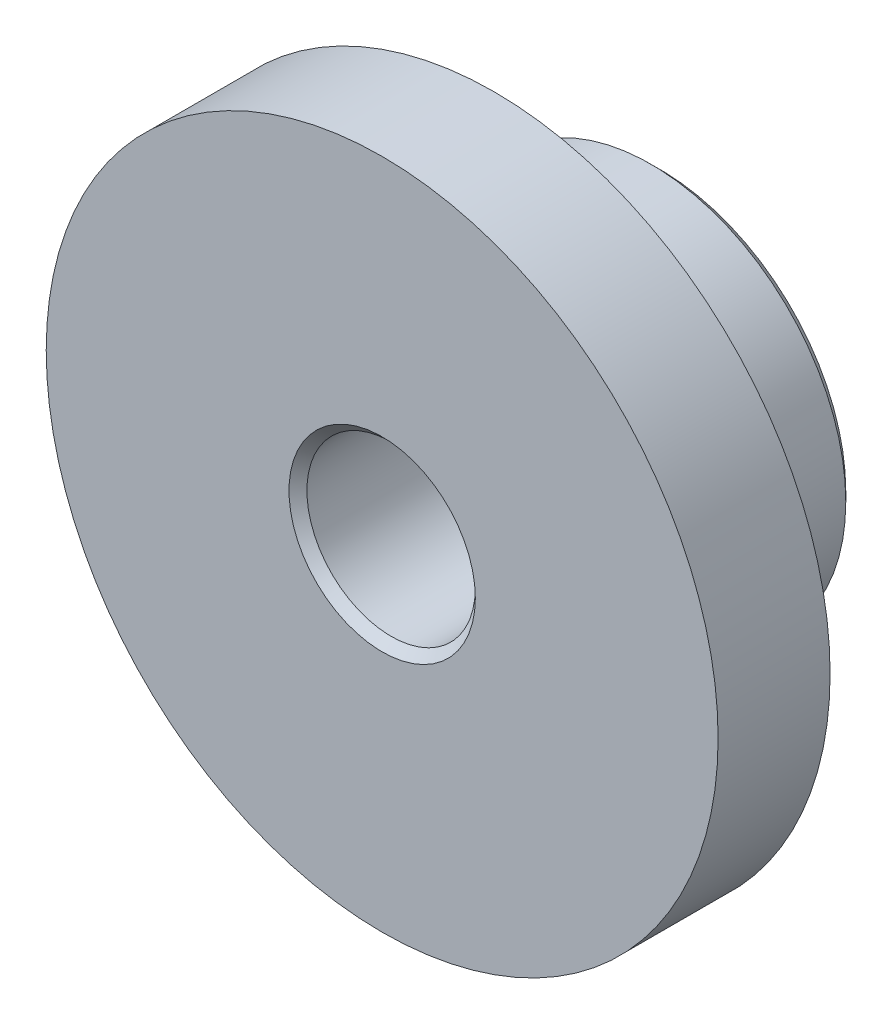
ISO-10303-21;
HEADER;
FILE_DESCRIPTION(('STEP AP214'),'2;1');
FILE_NAME('part.step','',(''),(''),'','','');
FILE_SCHEMA(('AUTOMOTIVE_DESIGN { 1 0 10303 214 1 1 1 1 }'));
ENDSEC;
DATA;
#1=APPLICATION_CONTEXT('core data for automotive mechanical design processes');
#2=APPLICATION_PROTOCOL_DEFINITION('international standard','automotive_design',2000,#1);
#3=PRODUCT_CONTEXT('',#1,'mechanical');
#4=PRODUCT('Part','Part','',(#3));
#5=PRODUCT_RELATED_PRODUCT_CATEGORY('part','',(#4));
#6=PRODUCT_DEFINITION_FORMATION('','',#4);
#7=PRODUCT_DEFINITION_CONTEXT('part definition',#1,'design');
#8=PRODUCT_DEFINITION('design','',#6,#7);
#9=PRODUCT_DEFINITION_SHAPE('','',#8);
#10=(LENGTH_UNIT() NAMED_UNIT(*) SI_UNIT(.MILLI.,.METRE.));
#11=(NAMED_UNIT(*) PLANE_ANGLE_UNIT() SI_UNIT($,.RADIAN.));
#12=(NAMED_UNIT(*) SI_UNIT($,.STERADIAN.) SOLID_ANGLE_UNIT());
#13=UNCERTAINTY_MEASURE_WITH_UNIT(LENGTH_MEASURE(1.E-05),#10,'distance_accuracy_value','');
#14=(GEOMETRIC_REPRESENTATION_CONTEXT(3) GLOBAL_UNCERTAINTY_ASSIGNED_CONTEXT((#13)) GLOBAL_UNIT_ASSIGNED_CONTEXT((#10,
#11,#12)) REPRESENTATION_CONTEXT('',''));
#15=CARTESIAN_POINT('',(0.,0.,0.));
#16=DIRECTION('',(0.,0.,1.));
#17=DIRECTION('',(1.,0.,0.));
#18=AXIS2_PLACEMENT_3D('',#15,#16,#17);
#19=CARTESIAN_POINT('',(0.,0.,15.748));
#20=DIRECTION('',(0.,0.,-1.));
#21=DIRECTION('',(-1.,0.,0.));
#22=AXIS2_PLACEMENT_3D('',#19,#20,#21);
#23=CYLINDRICAL_SURFACE('',#22,19.05);
#24=CARTESIAN_POINT('',(0.,0.,15.748));
#25=DIRECTION('',(0.,0.,1.));
#26=DIRECTION('',(1.,0.,0.));
#27=AXIS2_PLACEMENT_3D('',#24,#25,#26);
#28=CIRCLE('',#27,19.05);
#29=CARTESIAN_POINT('',(19.05,0.,15.748));
#30=VERTEX_POINT('',#29);
#31=EDGE_CURVE('E51',#30,#30,#28,.T.);
#32=ORIENTED_EDGE('',*,*,#31,.F.);
#33=EDGE_LOOP('',(#32));
#34=FACE_BOUND('',#33,.T.);
#35=CARTESIAN_POINT('',(0.,0.,9.398));
#36=DIRECTION('',(0.,0.,-1.));
#37=DIRECTION('',(-1.,0.,0.));
#38=AXIS2_PLACEMENT_3D('',#35,#36,#37);
#39=CIRCLE('',#38,19.05);
#40=CARTESIAN_POINT('',(-19.05,0.,9.398));
#41=VERTEX_POINT('',#40);
#42=EDGE_CURVE('E54',#41,#41,#39,.T.);
#43=ORIENTED_EDGE('',*,*,#42,.F.);
#44=EDGE_LOOP('',(#43));
#45=FACE_BOUND('',#44,.T.);
#46=ADVANCED_FACE('F31',(#34,#45),#23,.T.);
#47=CARTESIAN_POINT('',(0.,0.,15.748));
#48=DIRECTION('',(0.,0.,1.));
#49=DIRECTION('',(1.,0.,0.));
#50=AXIS2_PLACEMENT_3D('',#47,#48,#49);
#51=PLANE('',#50);
#52=CARTESIAN_POINT('',(0.,0.,15.748));
#53=DIRECTION('',(0.,0.,1.));
#54=DIRECTION('',(1.,0.,0.));
#55=AXIS2_PLACEMENT_3D('',#52,#53,#54);
#56=CIRCLE('',#55,5.28320000000004);
#57=CARTESIAN_POINT('',(5.28320000000004,0.,15.748));
#58=VERTEX_POINT('',#57);
#59=EDGE_CURVE('E10',#58,#58,#56,.F.);
#60=ORIENTED_EDGE('',*,*,#59,.T.);
#61=EDGE_LOOP('',(#60));
#62=FACE_BOUND('',#61,.T.);
#63=ORIENTED_EDGE('',*,*,#31,.T.);
#64=EDGE_LOOP('',(#63));
#65=FACE_BOUND('',#64,.T.);
#66=ADVANCED_FACE('F81',(#62,#65),#51,.T.);
#67=CARTESIAN_POINT('',(0.,0.,9.398));
#68=DIRECTION('',(0.,0.,-1.));
#69=DIRECTION('',(-1.,0.,0.));
#70=AXIS2_PLACEMENT_3D('',#67,#68,#69);
#71=PLANE('',#70);
#72=CARTESIAN_POINT('',(0.,0.,9.398));
#73=DIRECTION('',(0.,0.,-1.));
#74=DIRECTION('',(-1.,0.,0.));
#75=AXIS2_PLACEMENT_3D('',#72,#73,#74);
#76=CIRCLE('',#75,11.049);
#77=CARTESIAN_POINT('',(-11.049,0.,9.398));
#78=VERTEX_POINT('',#77);
#79=EDGE_CURVE('E57',#78,#78,#76,.T.);
#80=ORIENTED_EDGE('',*,*,#79,.F.);
#81=EDGE_LOOP('',(#80));
#82=FACE_BOUND('',#81,.T.);
#83=ORIENTED_EDGE('',*,*,#42,.T.);
#84=EDGE_LOOP('',(#83));
#85=FACE_BOUND('',#84,.T.);
#86=ADVANCED_FACE('F87',(#82,#85),#71,.T.);
#87=CARTESIAN_POINT('',(0.,0.,9.398));
#88=DIRECTION('',(0.,0.,-1.));
#89=DIRECTION('',(-1.,0.,0.));
#90=AXIS2_PLACEMENT_3D('',#87,#88,#89);
#91=CYLINDRICAL_SURFACE('',#90,11.049);
#92=CARTESIAN_POINT('',(0.,0.,0.508000000000008));
#93=DIRECTION('',(0.,0.,1.));
#94=DIRECTION('',(1.,0.,0.));
#95=AXIS2_PLACEMENT_3D('',#92,#93,#94);
#96=CIRCLE('',#95,11.049);
#97=CARTESIAN_POINT('',(11.049,0.,0.508000000000008));
#98=VERTEX_POINT('',#97);
#99=EDGE_CURVE('E42',#98,#98,#96,.T.);
#100=ORIENTED_EDGE('',*,*,#99,.T.);
#101=EDGE_LOOP('',(#100));
#102=FACE_BOUND('',#101,.T.);
#103=ORIENTED_EDGE('',*,*,#79,.T.);
#104=EDGE_LOOP('',(#103));
#105=FACE_BOUND('',#104,.T.);
#106=ADVANCED_FACE('F76',(#102,#105),#91,.T.);
#107=CARTESIAN_POINT('',(0.,0.,0.));
#108=DIRECTION('',(0.,0.,1.));
#109=DIRECTION('',(1.,0.,0.));
#110=AXIS2_PLACEMENT_3D('',#107,#108,#109);
#111=PLANE('',#110);
#112=CARTESIAN_POINT('',(0.,0.,0.));
#113=DIRECTION('',(0.,0.,1.));
#114=DIRECTION('',(1.,0.,0.));
#115=AXIS2_PLACEMENT_3D('',#112,#113,#114);
#116=CIRCLE('',#115,10.541);
#117=CARTESIAN_POINT('',(10.541,0.,0.));
#118=VERTEX_POINT('',#117);
#119=EDGE_CURVE('E46',#118,#118,#116,.F.);
#120=ORIENTED_EDGE('',*,*,#119,.T.);
#121=EDGE_LOOP('',(#120));
#122=FACE_BOUND('',#121,.T.);
#123=ADVANCED_FACE('F68',(#122),#111,.F.);
#124=CARTESIAN_POINT('',(0.,0.,3.556));
#125=DIRECTION('',(0.,0.,1.));
#126=DIRECTION('',(1.,0.,0.));
#127=AXIS2_PLACEMENT_3D('',#124,#125,#126);
#128=CYLINDRICAL_SURFACE('',#127,4.7752);
#129=CARTESIAN_POINT('',(0.,0.,15.24));
#130=DIRECTION('',(0.,0.,1.));
#131=DIRECTION('',(1.,0.,0.));
#132=AXIS2_PLACEMENT_3D('',#129,#130,#131);
#133=CIRCLE('',#132,4.7752);
#134=CARTESIAN_POINT('',(4.7752,0.,15.24));
#135=VERTEX_POINT('',#134);
#136=EDGE_CURVE('E38',#135,#135,#133,.T.);
#137=ORIENTED_EDGE('',*,*,#136,.T.);
#138=EDGE_LOOP('',(#137));
#139=FACE_BOUND('',#138,.T.);
#140=CARTESIAN_POINT('',(0.,0.,3.556));
#141=DIRECTION('',(0.,0.,1.));
#142=DIRECTION('',(1.,0.,0.));
#143=AXIS2_PLACEMENT_3D('',#140,#141,#142);
#144=CIRCLE('',#143,4.7752);
#145=CARTESIAN_POINT('',(4.7752,0.,3.556));
#146=VERTEX_POINT('',#145);
#147=EDGE_CURVE('E60',#146,#146,#144,.T.);
#148=ORIENTED_EDGE('',*,*,#147,.F.);
#149=EDGE_LOOP('',(#148));
#150=FACE_BOUND('',#149,.T.);
#151=ADVANCED_FACE('F66',(#139,#150),#128,.F.);
#152=CARTESIAN_POINT('',(0.,0.,3.556));
#153=DIRECTION('',(0.,0.,1.));
#154=DIRECTION('',(1.,0.,0.));
#155=AXIS2_PLACEMENT_3D('',#152,#153,#154);
#156=PLANE('',#155);
#157=ORIENTED_EDGE('',*,*,#147,.T.);
#158=EDGE_LOOP('',(#157));
#159=FACE_BOUND('',#158,.T.);
#160=ADVANCED_FACE('F64',(#159),#156,.T.);
#161=CARTESIAN_POINT('',(0.,0.,0.));
#162=DIRECTION('',(0.,0.,1.));
#163=DIRECTION('',(1.,0.,0.));
#164=AXIS2_PLACEMENT_3D('',#161,#162,#163);
#165=CONICAL_SURFACE('',#164,10.541,0.785398163397445);
#166=ORIENTED_EDGE('',*,*,#99,.F.);
#167=EDGE_LOOP('',(#166));
#168=FACE_BOUND('',#167,.T.);
#169=ORIENTED_EDGE('',*,*,#119,.F.);
#170=EDGE_LOOP('',(#169));
#171=FACE_BOUND('',#170,.T.);
#172=ADVANCED_FACE('F74',(#168,#171),#165,.T.);
#173=CARTESIAN_POINT('',(0.,0.,15.24));
#174=DIRECTION('',(0.,0.,1.));
#175=DIRECTION('',(1.,0.,0.));
#176=AXIS2_PLACEMENT_3D('',#173,#174,#175);
#177=CONICAL_SURFACE('',#176,4.7752,0.785398163397449);
#178=ORIENTED_EDGE('',*,*,#59,.F.);
#179=EDGE_LOOP('',(#178));
#180=FACE_BOUND('',#179,.T.);
#181=ORIENTED_EDGE('',*,*,#136,.F.);
#182=EDGE_LOOP('',(#181));
#183=FACE_BOUND('',#182,.T.);
#184=ADVANCED_FACE('F33',(#180,#183),#177,.F.);
#185=CLOSED_SHELL('',(#46,#66,#86,#106,#123,#151,#160,#172,#184));
#186=MANIFOLD_SOLID_BREP('B2',#185);
#187=ADVANCED_BREP_SHAPE_REPRESENTATION('',(#18,#186),#14);
#188=SHAPE_DEFINITION_REPRESENTATION(#9,#187);
ENDSEC;
END-ISO-10303-21;
